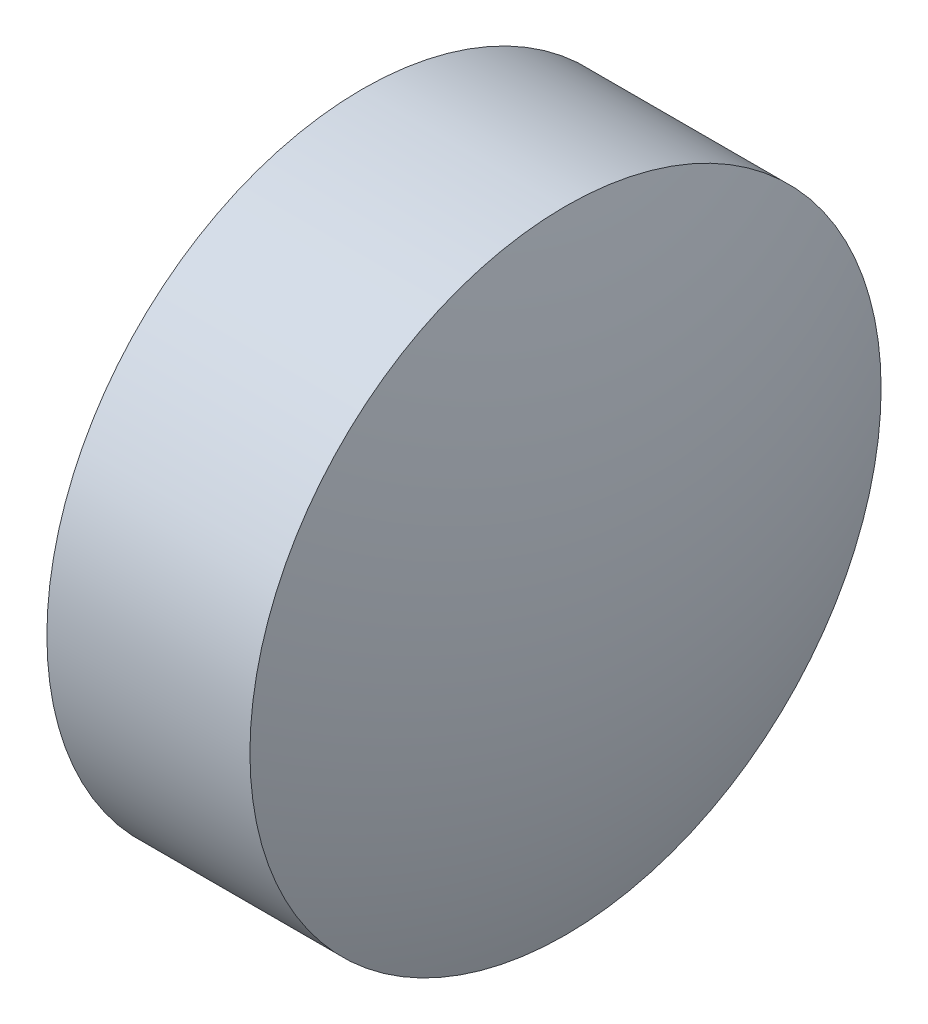
ISO-10303-21;
HEADER;
FILE_DESCRIPTION(('STEP AP214'),'2;1');
FILE_NAME('part.step','',(''),(''),'','','');
FILE_SCHEMA(('AUTOMOTIVE_DESIGN { 1 0 10303 214 1 1 1 1 }'));
ENDSEC;
DATA;
#1=APPLICATION_CONTEXT('core data for automotive mechanical design processes');
#2=APPLICATION_PROTOCOL_DEFINITION('international standard','automotive_design',2000,#1);
#3=PRODUCT_CONTEXT('',#1,'mechanical');
#4=PRODUCT('Part','Part','',(#3));
#5=PRODUCT_RELATED_PRODUCT_CATEGORY('part','',(#4));
#6=PRODUCT_DEFINITION_FORMATION('','',#4);
#7=PRODUCT_DEFINITION_CONTEXT('part definition',#1,'design');
#8=PRODUCT_DEFINITION('design','',#6,#7);
#9=PRODUCT_DEFINITION_SHAPE('','',#8);
#10=(LENGTH_UNIT() NAMED_UNIT(*) SI_UNIT(.MILLI.,.METRE.));
#11=(NAMED_UNIT(*) PLANE_ANGLE_UNIT() SI_UNIT($,.RADIAN.));
#12=(NAMED_UNIT(*) SI_UNIT($,.STERADIAN.) SOLID_ANGLE_UNIT());
#13=UNCERTAINTY_MEASURE_WITH_UNIT(LENGTH_MEASURE(1.E-05),#10,'distance_accuracy_value','');
#14=(GEOMETRIC_REPRESENTATION_CONTEXT(3) GLOBAL_UNCERTAINTY_ASSIGNED_CONTEXT((#13)) GLOBAL_UNIT_ASSIGNED_CONTEXT((#10,
#11,#12)) REPRESENTATION_CONTEXT('',''));
#15=CARTESIAN_POINT('',(0.,0.,0.));
#16=DIRECTION('',(0.,0.,1.));
#17=DIRECTION('',(1.,0.,0.));
#18=AXIS2_PLACEMENT_3D('',#15,#16,#17);
#19=CARTESIAN_POINT('',(27.6020058877699,11.4841211865791,0.));
#20=DIRECTION('',(-1.,0.,0.));
#21=DIRECTION('',(0.,1.,0.));
#22=AXIS2_PLACEMENT_3D('',#19,#20,#21);
#23=SPHERICAL_SURFACE('',#22,8.67880193649981);
#24=CARTESIAN_POINT('',(19.4581982369844,11.4841211865791,0.));
#25=DIRECTION('',(-1.,0.,0.));
#26=DIRECTION('',(0.,0.,1.));
#27=AXIS2_PLACEMENT_3D('',#24,#25,#26);
#28=CIRCLE('',#27,3.);
#29=CARTESIAN_POINT('',(19.4581982369844,11.4841211865791,3.));
#30=VERTEX_POINT('',#29);
#31=EDGE_CURVE('E40',#30,#30,#28,.T.);
#32=ORIENTED_EDGE('',*,*,#31,.T.);
#33=EDGE_LOOP('',(#32));
#34=FACE_BOUND('',#33,.T.);
#35=ADVANCED_FACE('F34',(#34),#23,.T.);
#36=CARTESIAN_POINT('',(13.2443848719131,11.4841211865791,0.));
#37=DIRECTION('',(-1.,0.,0.));
#38=DIRECTION('',(0.,-1.,0.));
#39=AXIS2_PLACEMENT_3D('',#36,#37,#38);
#40=SPHERICAL_SURFACE('',#39,8.67880193649984);
#41=CARTESIAN_POINT('',(21.3881925226987,11.4841211865791,0.));
#42=DIRECTION('',(-1.,0.,0.));
#43=DIRECTION('',(0.,0.,1.));
#44=AXIS2_PLACEMENT_3D('',#41,#42,#43);
#45=CIRCLE('',#44,3.);
#46=CARTESIAN_POINT('',(21.3881925226987,11.4841211865791,3.));
#47=VERTEX_POINT('',#46);
#48=EDGE_CURVE('E10',#47,#47,#45,.T.);
#49=ORIENTED_EDGE('',*,*,#48,.F.);
#50=EDGE_LOOP('',(#49));
#51=FACE_BOUND('',#50,.T.);
#52=ADVANCED_FACE('F49',(#51),#40,.T.);
#53=CARTESIAN_POINT('',(17.3949476563154,11.4841211865791,0.));
#54=DIRECTION('',(-1.,0.,0.));
#55=DIRECTION('',(0.,0.,1.));
#56=AXIS2_PLACEMENT_3D('',#53,#54,#55);
#57=CYLINDRICAL_SURFACE('',#56,3.);
#58=ORIENTED_EDGE('',*,*,#48,.T.);
#59=EDGE_LOOP('',(#58));
#60=FACE_BOUND('',#59,.T.);
#61=ORIENTED_EDGE('',*,*,#31,.F.);
#62=EDGE_LOOP('',(#61));
#63=FACE_BOUND('',#62,.T.);
#64=ADVANCED_FACE('F47',(#60,#63),#57,.T.);
#65=CLOSED_SHELL('',(#35,#52,#64));
#66=MANIFOLD_SOLID_BREP('B2',#65);
#67=ADVANCED_BREP_SHAPE_REPRESENTATION('',(#18,#66),#14);
#68=SHAPE_DEFINITION_REPRESENTATION(#9,#67);
ENDSEC;
END-ISO-10303-21;
